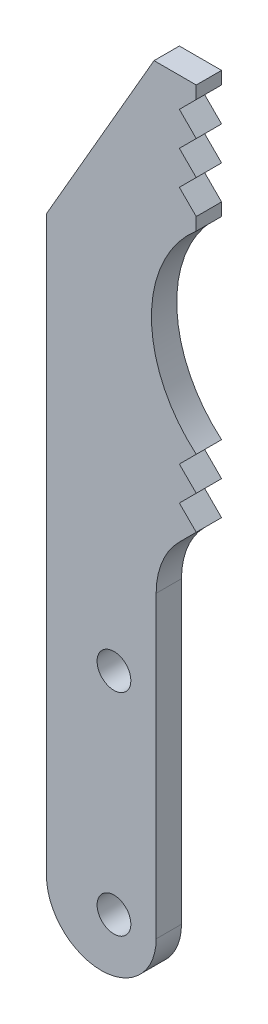
ISO-10303-21;
HEADER;
FILE_DESCRIPTION(('STEP AP214'),'2;1');
FILE_NAME('part.step','',(''),(''),'','','');
FILE_SCHEMA(('AUTOMOTIVE_DESIGN { 1 0 10303 214 1 1 1 1 }'));
ENDSEC;
DATA;
#1=APPLICATION_CONTEXT('core data for automotive mechanical design processes');
#2=APPLICATION_PROTOCOL_DEFINITION('international standard','automotive_design',2000,#1);
#3=PRODUCT_CONTEXT('',#1,'mechanical');
#4=PRODUCT('Part','Part','',(#3));
#5=PRODUCT_RELATED_PRODUCT_CATEGORY('part','',(#4));
#6=PRODUCT_DEFINITION_FORMATION('','',#4);
#7=PRODUCT_DEFINITION_CONTEXT('part definition',#1,'design');
#8=PRODUCT_DEFINITION('design','',#6,#7);
#9=PRODUCT_DEFINITION_SHAPE('','',#8);
#10=(LENGTH_UNIT() NAMED_UNIT(*) SI_UNIT(.MILLI.,.METRE.));
#11=(NAMED_UNIT(*) PLANE_ANGLE_UNIT() SI_UNIT($,.RADIAN.));
#12=(NAMED_UNIT(*) SI_UNIT($,.STERADIAN.) SOLID_ANGLE_UNIT());
#13=UNCERTAINTY_MEASURE_WITH_UNIT(LENGTH_MEASURE(1.E-05),#10,'distance_accuracy_value','');
#14=(GEOMETRIC_REPRESENTATION_CONTEXT(3) GLOBAL_UNCERTAINTY_ASSIGNED_CONTEXT((#13)) GLOBAL_UNIT_ASSIGNED_CONTEXT((#10,
#11,#12)) REPRESENTATION_CONTEXT('',''));
#15=CARTESIAN_POINT('',(0.,0.,0.));
#16=DIRECTION('',(0.,0.,1.));
#17=DIRECTION('',(1.,0.,0.));
#18=AXIS2_PLACEMENT_3D('',#15,#16,#17);
#19=CARTESIAN_POINT('',(-11.25,0.,1.5));
#20=DIRECTION('',(0.,0.,1.));
#21=DIRECTION('',(1.,0.,0.));
#22=AXIS2_PLACEMENT_3D('',#19,#20,#21);
#23=PLANE('',#22);
#24=CARTESIAN_POINT('',(-9.74999999999999,0.,1.5));
#25=DIRECTION('',(0.,0.,1.));
#26=DIRECTION('',(1.,0.,0.));
#27=AXIS2_PLACEMENT_3D('',#24,#25,#26);
#28=CIRCLE('',#27,2.);
#29=CARTESIAN_POINT('',(-7.74999999999999,0.,1.5));
#30=VERTEX_POINT('',#29);
#31=EDGE_CURVE('E213',#30,#30,#28,.T.);
#32=ORIENTED_EDGE('',*,*,#31,.F.);
#33=EDGE_LOOP('',(#32));
#34=FACE_BOUND('',#33,.T.);
#35=DIRECTION('',(-1.,0.,0.));
#36=VECTOR('',#35,1.);
#37=CARTESIAN_POINT('',(0.,90.,1.5));
#38=LINE('',#37,#36);
#39=CARTESIAN_POINT('',(0.,90.,1.5));
#40=VERTEX_POINT('',#39);
#41=CARTESIAN_POINT('',(-5.,90.,1.5));
#42=VERTEX_POINT('',#41);
#43=EDGE_CURVE('E248',#40,#42,#38,.T.);
#44=ORIENTED_EDGE('',*,*,#43,.T.);
#45=DIRECTION('',(-0.499999999999995,-0.866025403784442,0.));
#46=VECTOR('',#45,1.);
#47=CARTESIAN_POINT('',(-5.,90.,1.5));
#48=LINE('',#47,#46);
#49=CARTESIAN_POINT('',(-17.75,67.9163522034965,1.5));
#50=VERTEX_POINT('',#49);
#51=EDGE_CURVE('E136',#42,#50,#48,.T.);
#52=ORIENTED_EDGE('',*,*,#51,.T.);
#53=DIRECTION('',(0.,-1.,0.));
#54=VECTOR('',#53,1.);
#55=CARTESIAN_POINT('',(-17.75,67.9163522034965,1.5));
#56=LINE('',#55,#54);
#57=CARTESIAN_POINT('',(-17.75,0.,1.5));
#58=VERTEX_POINT('',#57);
#59=EDGE_CURVE('E299',#50,#58,#56,.T.);
#60=ORIENTED_EDGE('',*,*,#59,.T.);
#61=CARTESIAN_POINT('',(-11.25,0.,1.5));
#62=DIRECTION('',(0.,0.,1.));
#63=DIRECTION('',(1.,0.,0.));
#64=AXIS2_PLACEMENT_3D('',#61,#62,#63);
#65=CIRCLE('',#64,6.5);
#66=CARTESIAN_POINT('',(-4.74999999999999,0.,1.5));
#67=VERTEX_POINT('',#66);
#68=EDGE_CURVE('E318',#58,#67,#65,.T.);
#69=ORIENTED_EDGE('',*,*,#68,.T.);
#70=DIRECTION('',(0.,1.,0.));
#71=VECTOR('',#70,1.);
#72=CARTESIAN_POINT('',(-4.74999999999999,0.,1.5));
#73=LINE('',#72,#71);
#74=CARTESIAN_POINT('',(-4.74999999999999,35.460912703474,1.5));
#75=VERTEX_POINT('',#74);
#76=EDGE_CURVE('E315',#67,#75,#73,.T.);
#77=ORIENTED_EDGE('',*,*,#76,.T.);
#78=CARTESIAN_POINT('',(4.63908729652598,35.460912703474,1.5));
#79=DIRECTION('',(0.,0.,-1.));
#80=DIRECTION('',(1.,0.,0.));
#81=AXIS2_PLACEMENT_3D('',#78,#79,#80);
#82=CIRCLE('',#81,9.38908729652598);
#83=CARTESIAN_POINT('',(-2.,42.1,1.5));
#84=VERTEX_POINT('',#83);
#85=EDGE_CURVE('E317',#75,#84,#82,.T.);
#86=ORIENTED_EDGE('',*,*,#85,.T.);
#87=DIRECTION('',(0.707106781186545,0.70710678118655,0.));
#88=VECTOR('',#87,1.);
#89=CARTESIAN_POINT('',(-2.,42.1,1.5));
#90=LINE('',#89,#88);
#91=CARTESIAN_POINT('',(0.,44.1,1.5));
#92=VERTEX_POINT('',#91);
#93=EDGE_CURVE('E320',#84,#92,#90,.T.);
#94=ORIENTED_EDGE('',*,*,#93,.T.);
#95=DIRECTION('',(-0.707106781186543,0.707106781186552,0.));
#96=VECTOR('',#95,1.);
#97=CARTESIAN_POINT('',(0.,44.1,1.5));
#98=LINE('',#97,#96);
#99=CARTESIAN_POINT('',(-1.99999999999996,46.1,1.5));
#100=VERTEX_POINT('',#99);
#101=EDGE_CURVE('E326',#92,#100,#98,.T.);
#102=ORIENTED_EDGE('',*,*,#101,.T.);
#103=DIRECTION('',(0.707106781186545,0.70710678118655,0.));
#104=VECTOR('',#103,1.);
#105=CARTESIAN_POINT('',(-1.99999999999996,46.1,1.5));
#106=LINE('',#105,#104);
#107=CARTESIAN_POINT('',(0.,48.1,1.5));
#108=VERTEX_POINT('',#107);
#109=EDGE_CURVE('E328',#100,#108,#106,.T.);
#110=ORIENTED_EDGE('',*,*,#109,.T.);
#111=DIRECTION('',(-0.707106781186543,0.707106781186552,0.));
#112=VECTOR('',#111,1.);
#113=CARTESIAN_POINT('',(0.,48.1,1.5));
#114=LINE('',#113,#112);
#115=CARTESIAN_POINT('',(-1.99999999999992,50.1,1.5));
#116=VERTEX_POINT('',#115);
#117=EDGE_CURVE('E330',#108,#116,#114,.T.);
#118=ORIENTED_EDGE('',*,*,#117,.T.);
#119=DIRECTION('',(0.707106781186548,0.707106781186547,0.));
#120=VECTOR('',#119,1.);
#121=CARTESIAN_POINT('',(-1.99999999999992,50.1,1.5));
#122=LINE('',#121,#120);
#123=CARTESIAN_POINT('',(0.,52.1,1.5));
#124=VERTEX_POINT('',#123);
#125=EDGE_CURVE('E332',#116,#124,#122,.T.);
#126=ORIENTED_EDGE('',*,*,#125,.T.);
#127=CARTESIAN_POINT('',(9.69007223915278,63.55,1.5));
#128=DIRECTION('',(0.,0.,-1.));
#129=DIRECTION('',(1.,0.,0.));
#130=AXIS2_PLACEMENT_3D('',#127,#128,#129);
#131=CIRCLE('',#130,14.9999999999999);
#132=CARTESIAN_POINT('',(0.,75.,1.5));
#133=VERTEX_POINT('',#132);
#134=EDGE_CURVE('E334',#124,#133,#131,.T.);
#135=ORIENTED_EDGE('',*,*,#134,.T.);
#136=DIRECTION('',(0.,1.,0.));
#137=VECTOR('',#136,1.);
#138=CARTESIAN_POINT('',(0.,76.5,1.5));
#139=LINE('',#138,#137);
#140=CARTESIAN_POINT('',(0.,76.5,1.5));
#141=VERTEX_POINT('',#140);
#142=EDGE_CURVE('E336',#133,#141,#139,.T.);
#143=ORIENTED_EDGE('',*,*,#142,.T.);
#144=DIRECTION('',(-0.707106781186548,0.707106781186547,0.));
#145=VECTOR('',#144,1.);
#146=CARTESIAN_POINT('',(-1.99999999999992,78.5,1.5));
#147=LINE('',#146,#145);
#148=CARTESIAN_POINT('',(-1.99999999999992,78.5,1.5));
#149=VERTEX_POINT('',#148);
#150=EDGE_CURVE('E338',#141,#149,#147,.T.);
#151=ORIENTED_EDGE('',*,*,#150,.T.);
#152=DIRECTION('',(0.707106781186543,0.707106781186552,0.));
#153=VECTOR('',#152,1.);
#154=CARTESIAN_POINT('',(0.,80.5,1.5));
#155=LINE('',#154,#153);
#156=CARTESIAN_POINT('',(0.,80.5,1.5));
#157=VERTEX_POINT('',#156);
#158=EDGE_CURVE('E340',#149,#157,#155,.T.);
#159=ORIENTED_EDGE('',*,*,#158,.T.);
#160=DIRECTION('',(-0.707106781186545,0.70710678118655,0.));
#161=VECTOR('',#160,1.);
#162=CARTESIAN_POINT('',(-1.99999999999996,82.5,1.5));
#163=LINE('',#162,#161);
#164=CARTESIAN_POINT('',(-1.99999999999996,82.5,1.5));
#165=VERTEX_POINT('',#164);
#166=EDGE_CURVE('E342',#157,#165,#163,.T.);
#167=ORIENTED_EDGE('',*,*,#166,.T.);
#168=DIRECTION('',(0.707106781186543,0.707106781186552,0.));
#169=VECTOR('',#168,1.);
#170=CARTESIAN_POINT('',(0.,84.5,1.5));
#171=LINE('',#170,#169);
#172=CARTESIAN_POINT('',(0.,84.5,1.5));
#173=VERTEX_POINT('',#172);
#174=EDGE_CURVE('E191',#165,#173,#171,.T.);
#175=ORIENTED_EDGE('',*,*,#174,.T.);
#176=DIRECTION('',(-0.707106781186545,0.70710678118655,0.));
#177=VECTOR('',#176,1.);
#178=CARTESIAN_POINT('',(-2.,86.5,1.5));
#179=LINE('',#178,#177);
#180=CARTESIAN_POINT('',(-2.,86.5,1.5));
#181=VERTEX_POINT('',#180);
#182=EDGE_CURVE('E185',#173,#181,#179,.T.);
#183=ORIENTED_EDGE('',*,*,#182,.T.);
#184=DIRECTION('',(0.707106781186548,0.707106781186547,0.));
#185=VECTOR('',#184,1.);
#186=CARTESIAN_POINT('',(0.,88.5,1.5));
#187=LINE('',#186,#185);
#188=CARTESIAN_POINT('',(0.,88.5,1.5));
#189=VERTEX_POINT('',#188);
#190=EDGE_CURVE('E189',#181,#189,#187,.T.);
#191=ORIENTED_EDGE('',*,*,#190,.T.);
#192=DIRECTION('',(0.,1.,0.));
#193=VECTOR('',#192,1.);
#194=CARTESIAN_POINT('',(0.,88.5,1.5));
#195=LINE('',#194,#193);
#196=EDGE_CURVE('E57',#189,#40,#195,.T.);
#197=ORIENTED_EDGE('',*,*,#196,.T.);
#198=EDGE_LOOP('',(#44,#52,#60,#69,#77,#86,#94,#102,#110,#118,#126,#135,#143,#151,#159,#167,
#175,#183,#191,#197));
#199=FACE_BOUND('',#198,.T.);
#200=CARTESIAN_POINT('',(-9.74999999999999,25.,1.5));
#201=DIRECTION('',(0.,0.,1.));
#202=DIRECTION('',(1.,0.,0.));
#203=AXIS2_PLACEMENT_3D('',#200,#201,#202);
#204=CIRCLE('',#203,2.);
#205=CARTESIAN_POINT('',(-7.74999999999999,25.,1.5));
#206=VERTEX_POINT('',#205);
#207=EDGE_CURVE('E384',#206,#206,#204,.T.);
#208=ORIENTED_EDGE('',*,*,#207,.F.);
#209=EDGE_LOOP('',(#208));
#210=FACE_BOUND('',#209,.T.);
#211=ADVANCED_FACE('F40',(#34,#199,#210),#23,.T.);
#212=CARTESIAN_POINT('',(-11.25,0.,-1.5));
#213=DIRECTION('',(0.,0.,1.));
#214=DIRECTION('',(1.,0.,0.));
#215=AXIS2_PLACEMENT_3D('',#212,#213,#214);
#216=PLANE('',#215);
#217=DIRECTION('',(-1.,0.,0.));
#218=VECTOR('',#217,1.);
#219=CARTESIAN_POINT('',(0.,90.,-1.5));
#220=LINE('',#219,#218);
#221=CARTESIAN_POINT('',(0.,90.,-1.5));
#222=VERTEX_POINT('',#221);
#223=CARTESIAN_POINT('',(-5.,90.,-1.5));
#224=VERTEX_POINT('',#223);
#225=EDGE_CURVE('E209',#222,#224,#220,.T.);
#226=ORIENTED_EDGE('',*,*,#225,.F.);
#227=DIRECTION('',(0.,1.,0.));
#228=VECTOR('',#227,1.);
#229=CARTESIAN_POINT('',(0.,88.5,-1.5));
#230=LINE('',#229,#228);
#231=CARTESIAN_POINT('',(0.,88.5,-1.5));
#232=VERTEX_POINT('',#231);
#233=EDGE_CURVE('E128',#232,#222,#230,.T.);
#234=ORIENTED_EDGE('',*,*,#233,.F.);
#235=DIRECTION('',(0.707106781186548,0.707106781186547,0.));
#236=VECTOR('',#235,1.);
#237=CARTESIAN_POINT('',(0.,88.5,-1.5));
#238=LINE('',#237,#236);
#239=CARTESIAN_POINT('',(-2.,86.5,-1.5));
#240=VERTEX_POINT('',#239);
#241=EDGE_CURVE('E122',#240,#232,#238,.T.);
#242=ORIENTED_EDGE('',*,*,#241,.F.);
#243=DIRECTION('',(-0.707106781186545,0.70710678118655,0.));
#244=VECTOR('',#243,1.);
#245=CARTESIAN_POINT('',(-2.,86.5,-1.5));
#246=LINE('',#245,#244);
#247=CARTESIAN_POINT('',(0.,84.5,-1.5));
#248=VERTEX_POINT('',#247);
#249=EDGE_CURVE('E199',#248,#240,#246,.T.);
#250=ORIENTED_EDGE('',*,*,#249,.F.);
#251=DIRECTION('',(0.707106781186543,0.707106781186552,0.));
#252=VECTOR('',#251,1.);
#253=CARTESIAN_POINT('',(0.,84.5,-1.5));
#254=LINE('',#253,#252);
#255=CARTESIAN_POINT('',(-1.99999999999996,82.5,-1.5));
#256=VERTEX_POINT('',#255);
#257=EDGE_CURVE('E243',#256,#248,#254,.T.);
#258=ORIENTED_EDGE('',*,*,#257,.F.);
#259=DIRECTION('',(-0.707106781186545,0.70710678118655,0.));
#260=VECTOR('',#259,1.);
#261=CARTESIAN_POINT('',(-1.99999999999996,82.5,-1.5));
#262=LINE('',#261,#260);
#263=CARTESIAN_POINT('',(0.,80.5,-1.5));
#264=VERTEX_POINT('',#263);
#265=EDGE_CURVE('E241',#264,#256,#262,.T.);
#266=ORIENTED_EDGE('',*,*,#265,.F.);
#267=DIRECTION('',(0.707106781186543,0.707106781186552,0.));
#268=VECTOR('',#267,1.);
#269=CARTESIAN_POINT('',(0.,80.5,-1.5));
#270=LINE('',#269,#268);
#271=CARTESIAN_POINT('',(-1.99999999999992,78.5,-1.5));
#272=VERTEX_POINT('',#271);
#273=EDGE_CURVE('E239',#272,#264,#270,.T.);
#274=ORIENTED_EDGE('',*,*,#273,.F.);
#275=DIRECTION('',(-0.707106781186548,0.707106781186547,0.));
#276=VECTOR('',#275,1.);
#277=CARTESIAN_POINT('',(-1.99999999999992,78.5,-1.5));
#278=LINE('',#277,#276);
#279=CARTESIAN_POINT('',(0.,76.5,-1.5));
#280=VERTEX_POINT('',#279);
#281=EDGE_CURVE('E237',#280,#272,#278,.T.);
#282=ORIENTED_EDGE('',*,*,#281,.F.);
#283=DIRECTION('',(0.,1.,0.));
#284=VECTOR('',#283,1.);
#285=CARTESIAN_POINT('',(0.,76.5,-1.5));
#286=LINE('',#285,#284);
#287=CARTESIAN_POINT('',(0.,75.,-1.5));
#288=VERTEX_POINT('',#287);
#289=EDGE_CURVE('E235',#288,#280,#286,.T.);
#290=ORIENTED_EDGE('',*,*,#289,.F.);
#291=CARTESIAN_POINT('',(9.69007223915278,63.55,-1.5));
#292=DIRECTION('',(0.,0.,-1.));
#293=DIRECTION('',(1.,0.,0.));
#294=AXIS2_PLACEMENT_3D('',#291,#292,#293);
#295=CIRCLE('',#294,14.9999999999999);
#296=CARTESIAN_POINT('',(0.,52.1,-1.5));
#297=VERTEX_POINT('',#296);
#298=EDGE_CURVE('E233',#297,#288,#295,.T.);
#299=ORIENTED_EDGE('',*,*,#298,.F.);
#300=DIRECTION('',(0.707106781186548,0.707106781186547,0.));
#301=VECTOR('',#300,1.);
#302=CARTESIAN_POINT('',(-1.99999999999992,50.1,-1.5));
#303=LINE('',#302,#301);
#304=CARTESIAN_POINT('',(-1.99999999999992,50.1,-1.5));
#305=VERTEX_POINT('',#304);
#306=EDGE_CURVE('E231',#305,#297,#303,.T.);
#307=ORIENTED_EDGE('',*,*,#306,.F.);
#308=DIRECTION('',(-0.707106781186543,0.707106781186552,0.));
#309=VECTOR('',#308,1.);
#310=CARTESIAN_POINT('',(0.,48.1,-1.5));
#311=LINE('',#310,#309);
#312=CARTESIAN_POINT('',(0.,48.1,-1.5));
#313=VERTEX_POINT('',#312);
#314=EDGE_CURVE('E229',#313,#305,#311,.T.);
#315=ORIENTED_EDGE('',*,*,#314,.F.);
#316=DIRECTION('',(0.707106781186545,0.70710678118655,0.));
#317=VECTOR('',#316,1.);
#318=CARTESIAN_POINT('',(-1.99999999999996,46.1,-1.5));
#319=LINE('',#318,#317);
#320=CARTESIAN_POINT('',(-1.99999999999996,46.1,-1.5));
#321=VERTEX_POINT('',#320);
#322=EDGE_CURVE('E227',#321,#313,#319,.T.);
#323=ORIENTED_EDGE('',*,*,#322,.F.);
#324=DIRECTION('',(-0.707106781186543,0.707106781186552,0.));
#325=VECTOR('',#324,1.);
#326=CARTESIAN_POINT('',(0.,44.1,-1.5));
#327=LINE('',#326,#325);
#328=CARTESIAN_POINT('',(0.,44.1,-1.5));
#329=VERTEX_POINT('',#328);
#330=EDGE_CURVE('E225',#329,#321,#327,.T.);
#331=ORIENTED_EDGE('',*,*,#330,.F.);
#332=DIRECTION('',(0.707106781186545,0.70710678118655,0.));
#333=VECTOR('',#332,1.);
#334=CARTESIAN_POINT('',(-2.,42.1,-1.5));
#335=LINE('',#334,#333);
#336=CARTESIAN_POINT('',(-2.,42.1,-1.5));
#337=VERTEX_POINT('',#336);
#338=EDGE_CURVE('E223',#337,#329,#335,.T.);
#339=ORIENTED_EDGE('',*,*,#338,.F.);
#340=CARTESIAN_POINT('',(4.63908729652598,35.460912703474,-1.5));
#341=DIRECTION('',(0.,0.,-1.));
#342=DIRECTION('',(1.,0.,0.));
#343=AXIS2_PLACEMENT_3D('',#340,#341,#342);
#344=CIRCLE('',#343,9.38908729652598);
#345=CARTESIAN_POINT('',(-4.74999999999999,35.460912703474,-1.5));
#346=VERTEX_POINT('',#345);
#347=EDGE_CURVE('E221',#346,#337,#344,.T.);
#348=ORIENTED_EDGE('',*,*,#347,.F.);
#349=DIRECTION('',(0.,1.,0.));
#350=VECTOR('',#349,1.);
#351=CARTESIAN_POINT('',(-4.74999999999999,0.,-1.5));
#352=LINE('',#351,#350);
#353=CARTESIAN_POINT('',(-4.74999999999999,0.,-1.5));
#354=VERTEX_POINT('',#353);
#355=EDGE_CURVE('E219',#354,#346,#352,.T.);
#356=ORIENTED_EDGE('',*,*,#355,.F.);
#357=CARTESIAN_POINT('',(-11.25,0.,-1.5));
#358=DIRECTION('',(0.,0.,1.));
#359=DIRECTION('',(1.,0.,0.));
#360=AXIS2_PLACEMENT_3D('',#357,#358,#359);
#361=CIRCLE('',#360,6.5);
#362=CARTESIAN_POINT('',(-17.75,0.,-1.5));
#363=VERTEX_POINT('',#362);
#364=EDGE_CURVE('E217',#363,#354,#361,.T.);
#365=ORIENTED_EDGE('',*,*,#364,.F.);
#366=DIRECTION('',(0.,-1.,0.));
#367=VECTOR('',#366,1.);
#368=CARTESIAN_POINT('',(-17.75,67.9163522034965,-1.5));
#369=LINE('',#368,#367);
#370=CARTESIAN_POINT('',(-17.75,67.9163522034965,-1.5));
#371=VERTEX_POINT('',#370);
#372=EDGE_CURVE('E215',#371,#363,#369,.T.);
#373=ORIENTED_EDGE('',*,*,#372,.F.);
#374=DIRECTION('',(-0.499999999999995,-0.866025403784442,0.));
#375=VECTOR('',#374,1.);
#376=CARTESIAN_POINT('',(-5.,90.,-1.5));
#377=LINE('',#376,#375);
#378=EDGE_CURVE('E212',#224,#371,#377,.T.);
#379=ORIENTED_EDGE('',*,*,#378,.F.);
#380=EDGE_LOOP('',(#226,#234,#242,#250,#258,#266,#274,#282,#290,#299,#307,#315,#323,#331,#339,
#348,#356,#365,#373,#379));
#381=FACE_BOUND('',#380,.T.);
#382=CARTESIAN_POINT('',(-9.74999999999999,0.,-1.5));
#383=DIRECTION('',(0.,0.,1.));
#384=DIRECTION('',(1.,0.,0.));
#385=AXIS2_PLACEMENT_3D('',#382,#383,#384);
#386=CIRCLE('',#385,2.);
#387=CARTESIAN_POINT('',(-7.74999999999999,0.,-1.5));
#388=VERTEX_POINT('',#387);
#389=EDGE_CURVE('E390',#388,#388,#386,.T.);
#390=ORIENTED_EDGE('',*,*,#389,.T.);
#391=EDGE_LOOP('',(#390));
#392=FACE_BOUND('',#391,.T.);
#393=CARTESIAN_POINT('',(-9.74999999999999,25.,-1.5));
#394=DIRECTION('',(0.,0.,1.));
#395=DIRECTION('',(1.,0.,0.));
#396=AXIS2_PLACEMENT_3D('',#393,#394,#395);
#397=CIRCLE('',#396,2.);
#398=CARTESIAN_POINT('',(-7.74999999999999,25.,-1.5));
#399=VERTEX_POINT('',#398);
#400=EDGE_CURVE('E387',#399,#399,#397,.T.);
#401=ORIENTED_EDGE('',*,*,#400,.T.);
#402=EDGE_LOOP('',(#401));
#403=FACE_BOUND('',#402,.T.);
#404=ADVANCED_FACE('F303',(#381,#392,#403),#216,.F.);
#405=CARTESIAN_POINT('',(0.,90.,1.5));
#406=DIRECTION('',(0.,-1.,0.));
#407=DIRECTION('',(0.,0.,-1.));
#408=AXIS2_PLACEMENT_3D('',#405,#406,#407);
#409=PLANE('',#408);
#410=ORIENTED_EDGE('',*,*,#225,.T.);
#411=DIRECTION('',(0.,0.,-1.));
#412=VECTOR('',#411,1.);
#413=CARTESIAN_POINT('',(-5.,90.,1.5));
#414=LINE('',#413,#412);
#415=EDGE_CURVE('E11',#42,#224,#414,.T.);
#416=ORIENTED_EDGE('',*,*,#415,.F.);
#417=ORIENTED_EDGE('',*,*,#43,.F.);
#418=DIRECTION('',(0.,0.,-1.));
#419=VECTOR('',#418,1.);
#420=CARTESIAN_POINT('',(0.,90.,1.5));
#421=LINE('',#420,#419);
#422=EDGE_CURVE('E205',#40,#222,#421,.T.);
#423=ORIENTED_EDGE('',*,*,#422,.T.);
#424=EDGE_LOOP('',(#410,#416,#417,#423));
#425=FACE_BOUND('',#424,.T.);
#426=ADVANCED_FACE('F42',(#425),#409,.F.);
#427=CARTESIAN_POINT('',(-5.,90.,1.5));
#428=DIRECTION('',(0.866025403784441,-0.499999999999995,0.));
#429=DIRECTION('',(0.499999999999995,0.866025403784442,0.));
#430=AXIS2_PLACEMENT_3D('',#427,#428,#429);
#431=PLANE('',#430);
#432=ORIENTED_EDGE('',*,*,#378,.T.);
#433=DIRECTION('',(0.,0.,-1.));
#434=VECTOR('',#433,1.);
#435=CARTESIAN_POINT('',(-17.75,67.9163522034965,1.5));
#436=LINE('',#435,#434);
#437=EDGE_CURVE('E49',#50,#371,#436,.T.);
#438=ORIENTED_EDGE('',*,*,#437,.F.);
#439=ORIENTED_EDGE('',*,*,#51,.F.);
#440=ORIENTED_EDGE('',*,*,#415,.T.);
#441=EDGE_LOOP('',(#432,#438,#439,#440));
#442=FACE_BOUND('',#441,.T.);
#443=ADVANCED_FACE('F581',(#442),#431,.F.);
#444=CARTESIAN_POINT('',(-17.75,67.9163522034965,1.5));
#445=DIRECTION('',(1.,0.,0.));
#446=DIRECTION('',(0.,1.,0.));
#447=AXIS2_PLACEMENT_3D('',#444,#445,#446);
#448=PLANE('',#447);
#449=ORIENTED_EDGE('',*,*,#372,.T.);
#450=DIRECTION('',(0.,0.,-1.));
#451=VECTOR('',#450,1.);
#452=CARTESIAN_POINT('',(-17.75,0.,1.5));
#453=LINE('',#452,#451);
#454=EDGE_CURVE('E291',#58,#363,#453,.T.);
#455=ORIENTED_EDGE('',*,*,#454,.F.);
#456=ORIENTED_EDGE('',*,*,#59,.F.);
#457=ORIENTED_EDGE('',*,*,#437,.T.);
#458=EDGE_LOOP('',(#449,#455,#456,#457));
#459=FACE_BOUND('',#458,.T.);
#460=ADVANCED_FACE('F297',(#459),#448,.F.);
#461=CARTESIAN_POINT('',(-11.25,0.,1.5));
#462=DIRECTION('',(0.,0.,-1.));
#463=DIRECTION('',(-1.,0.,0.));
#464=AXIS2_PLACEMENT_3D('',#461,#462,#463);
#465=CYLINDRICAL_SURFACE('',#464,6.5);
#466=ORIENTED_EDGE('',*,*,#364,.T.);
#467=DIRECTION('',(0.,0.,-1.));
#468=VECTOR('',#467,1.);
#469=CARTESIAN_POINT('',(-4.74999999999999,0.,1.5));
#470=LINE('',#469,#468);
#471=EDGE_CURVE('E288',#67,#354,#470,.T.);
#472=ORIENTED_EDGE('',*,*,#471,.F.);
#473=ORIENTED_EDGE('',*,*,#68,.F.);
#474=ORIENTED_EDGE('',*,*,#454,.T.);
#475=EDGE_LOOP('',(#466,#472,#473,#474));
#476=FACE_BOUND('',#475,.T.);
#477=ADVANCED_FACE('F309',(#476),#465,.T.);
#478=CARTESIAN_POINT('',(-4.74999999999999,0.,1.5));
#479=DIRECTION('',(-1.,0.,0.));
#480=DIRECTION('',(0.,-1.,0.));
#481=AXIS2_PLACEMENT_3D('',#478,#479,#480);
#482=PLANE('',#481);
#483=ORIENTED_EDGE('',*,*,#355,.T.);
#484=DIRECTION('',(0.,0.,-1.));
#485=VECTOR('',#484,1.);
#486=CARTESIAN_POINT('',(-4.74999999999999,35.460912703474,1.5));
#487=LINE('',#486,#485);
#488=EDGE_CURVE('E285',#75,#346,#487,.T.);
#489=ORIENTED_EDGE('',*,*,#488,.F.);
#490=ORIENTED_EDGE('',*,*,#76,.F.);
#491=ORIENTED_EDGE('',*,*,#471,.T.);
#492=EDGE_LOOP('',(#483,#489,#490,#491));
#493=FACE_BOUND('',#492,.T.);
#494=ADVANCED_FACE('F313',(#493),#482,.F.);
#495=CARTESIAN_POINT('',(4.63908729652598,35.460912703474,1.5));
#496=DIRECTION('',(0.,0.,-1.));
#497=DIRECTION('',(-1.,0.,0.));
#498=AXIS2_PLACEMENT_3D('',#495,#496,#497);
#499=CYLINDRICAL_SURFACE('',#498,9.38908729652598);
#500=ORIENTED_EDGE('',*,*,#347,.T.);
#501=DIRECTION('',(0.,0.,-1.));
#502=VECTOR('',#501,1.);
#503=CARTESIAN_POINT('',(-2.,42.1,1.5));
#504=LINE('',#503,#502);
#505=EDGE_CURVE('E282',#84,#337,#504,.T.);
#506=ORIENTED_EDGE('',*,*,#505,.F.);
#507=ORIENTED_EDGE('',*,*,#85,.F.);
#508=ORIENTED_EDGE('',*,*,#488,.T.);
#509=EDGE_LOOP('',(#500,#506,#507,#508));
#510=FACE_BOUND('',#509,.T.);
#511=ADVANCED_FACE('F542',(#510),#499,.F.);
#512=CARTESIAN_POINT('',(-2.,42.1,1.5));
#513=DIRECTION('',(-0.70710678118655,0.707106781186545,0.));
#514=DIRECTION('',(-0.707106781186545,-0.70710678118655,0.));
#515=AXIS2_PLACEMENT_3D('',#512,#513,#514);
#516=PLANE('',#515);
#517=ORIENTED_EDGE('',*,*,#338,.T.);
#518=DIRECTION('',(0.,0.,-1.));
#519=VECTOR('',#518,1.);
#520=CARTESIAN_POINT('',(0.,44.1,1.5));
#521=LINE('',#520,#519);
#522=EDGE_CURVE('E279',#92,#329,#521,.T.);
#523=ORIENTED_EDGE('',*,*,#522,.F.);
#524=ORIENTED_EDGE('',*,*,#93,.F.);
#525=ORIENTED_EDGE('',*,*,#505,.T.);
#526=EDGE_LOOP('',(#517,#523,#524,#525));
#527=FACE_BOUND('',#526,.T.);
#528=ADVANCED_FACE('F531',(#527),#516,.F.);
#529=CARTESIAN_POINT('',(0.,44.1,1.5));
#530=DIRECTION('',(-0.707106781186552,-0.707106781186543,0.));
#531=DIRECTION('',(0.707106781186543,-0.707106781186552,0.));
#532=AXIS2_PLACEMENT_3D('',#529,#530,#531);
#533=PLANE('',#532);
#534=ORIENTED_EDGE('',*,*,#330,.T.);
#535=DIRECTION('',(0.,0.,-1.));
#536=VECTOR('',#535,1.);
#537=CARTESIAN_POINT('',(-1.99999999999996,46.1,1.5));
#538=LINE('',#537,#536);
#539=EDGE_CURVE('E276',#100,#321,#538,.T.);
#540=ORIENTED_EDGE('',*,*,#539,.F.);
#541=ORIENTED_EDGE('',*,*,#101,.F.);
#542=ORIENTED_EDGE('',*,*,#522,.T.);
#543=EDGE_LOOP('',(#534,#540,#541,#542));
#544=FACE_BOUND('',#543,.T.);
#545=ADVANCED_FACE('F520',(#544),#533,.F.);
#546=CARTESIAN_POINT('',(-1.99999999999996,46.1,1.5));
#547=DIRECTION('',(-0.70710678118655,0.707106781186545,0.));
#548=DIRECTION('',(-0.707106781186545,-0.70710678118655,0.));
#549=AXIS2_PLACEMENT_3D('',#546,#547,#548);
#550=PLANE('',#549);
#551=ORIENTED_EDGE('',*,*,#322,.T.);
#552=DIRECTION('',(0.,0.,-1.));
#553=VECTOR('',#552,1.);
#554=CARTESIAN_POINT('',(0.,48.1,1.5));
#555=LINE('',#554,#553);
#556=EDGE_CURVE('E273',#108,#313,#555,.T.);
#557=ORIENTED_EDGE('',*,*,#556,.F.);
#558=ORIENTED_EDGE('',*,*,#109,.F.);
#559=ORIENTED_EDGE('',*,*,#539,.T.);
#560=EDGE_LOOP('',(#551,#557,#558,#559));
#561=FACE_BOUND('',#560,.T.);
#562=ADVANCED_FACE('F509',(#561),#550,.F.);
#563=CARTESIAN_POINT('',(0.,48.1,1.5));
#564=DIRECTION('',(-0.707106781186552,-0.707106781186543,0.));
#565=DIRECTION('',(0.707106781186543,-0.707106781186552,0.));
#566=AXIS2_PLACEMENT_3D('',#563,#564,#565);
#567=PLANE('',#566);
#568=ORIENTED_EDGE('',*,*,#314,.T.);
#569=DIRECTION('',(0.,0.,-1.));
#570=VECTOR('',#569,1.);
#571=CARTESIAN_POINT('',(-1.99999999999992,50.1,1.5));
#572=LINE('',#571,#570);
#573=EDGE_CURVE('E270',#116,#305,#572,.T.);
#574=ORIENTED_EDGE('',*,*,#573,.F.);
#575=ORIENTED_EDGE('',*,*,#117,.F.);
#576=ORIENTED_EDGE('',*,*,#556,.T.);
#577=EDGE_LOOP('',(#568,#574,#575,#576));
#578=FACE_BOUND('',#577,.T.);
#579=ADVANCED_FACE('F498',(#578),#567,.F.);
#580=CARTESIAN_POINT('',(-1.99999999999992,50.1,1.5));
#581=DIRECTION('',(-0.707106781186547,0.707106781186548,0.));
#582=DIRECTION('',(-0.707106781186548,-0.707106781186547,0.));
#583=AXIS2_PLACEMENT_3D('',#580,#581,#582);
#584=PLANE('',#583);
#585=ORIENTED_EDGE('',*,*,#306,.T.);
#586=DIRECTION('',(0.,0.,-1.));
#587=VECTOR('',#586,1.);
#588=CARTESIAN_POINT('',(0.,52.1,1.5));
#589=LINE('',#588,#587);
#590=EDGE_CURVE('E267',#124,#297,#589,.T.);
#591=ORIENTED_EDGE('',*,*,#590,.F.);
#592=ORIENTED_EDGE('',*,*,#125,.F.);
#593=ORIENTED_EDGE('',*,*,#573,.T.);
#594=EDGE_LOOP('',(#585,#591,#592,#593));
#595=FACE_BOUND('',#594,.T.);
#596=ADVANCED_FACE('F487',(#595),#584,.F.);
#597=CARTESIAN_POINT('',(9.69007223915278,63.55,1.5));
#598=DIRECTION('',(0.,0.,-1.));
#599=DIRECTION('',(-1.,0.,0.));
#600=AXIS2_PLACEMENT_3D('',#597,#598,#599);
#601=CYLINDRICAL_SURFACE('',#600,14.9999999999999);
#602=ORIENTED_EDGE('',*,*,#298,.T.);
#603=DIRECTION('',(0.,0.,-1.));
#604=VECTOR('',#603,1.);
#605=CARTESIAN_POINT('',(0.,75.,1.5));
#606=LINE('',#605,#604);
#607=EDGE_CURVE('E264',#133,#288,#606,.T.);
#608=ORIENTED_EDGE('',*,*,#607,.F.);
#609=ORIENTED_EDGE('',*,*,#134,.F.);
#610=ORIENTED_EDGE('',*,*,#590,.T.);
#611=EDGE_LOOP('',(#602,#608,#609,#610));
#612=FACE_BOUND('',#611,.T.);
#613=ADVANCED_FACE('F476',(#612),#601,.F.);
#614=CARTESIAN_POINT('',(0.,76.5,1.5));
#615=DIRECTION('',(-1.,0.,0.));
#616=DIRECTION('',(0.,-1.,0.));
#617=AXIS2_PLACEMENT_3D('',#614,#615,#616);
#618=PLANE('',#617);
#619=ORIENTED_EDGE('',*,*,#289,.T.);
#620=DIRECTION('',(0.,0.,-1.));
#621=VECTOR('',#620,1.);
#622=CARTESIAN_POINT('',(0.,76.5,1.5));
#623=LINE('',#622,#621);
#624=EDGE_CURVE('E261',#141,#280,#623,.T.);
#625=ORIENTED_EDGE('',*,*,#624,.F.);
#626=ORIENTED_EDGE('',*,*,#142,.F.);
#627=ORIENTED_EDGE('',*,*,#607,.T.);
#628=EDGE_LOOP('',(#619,#625,#626,#627));
#629=FACE_BOUND('',#628,.T.);
#630=ADVANCED_FACE('F465',(#629),#618,.F.);
#631=CARTESIAN_POINT('',(-1.99999999999992,78.5,1.5));
#632=DIRECTION('',(-0.707106781186547,-0.707106781186548,0.));
#633=DIRECTION('',(0.707106781186548,-0.707106781186547,0.));
#634=AXIS2_PLACEMENT_3D('',#631,#632,#633);
#635=PLANE('',#634);
#636=ORIENTED_EDGE('',*,*,#281,.T.);
#637=DIRECTION('',(0.,0.,-1.));
#638=VECTOR('',#637,1.);
#639=CARTESIAN_POINT('',(-1.99999999999992,78.5,1.5));
#640=LINE('',#639,#638);
#641=EDGE_CURVE('E258',#149,#272,#640,.T.);
#642=ORIENTED_EDGE('',*,*,#641,.F.);
#643=ORIENTED_EDGE('',*,*,#150,.F.);
#644=ORIENTED_EDGE('',*,*,#624,.T.);
#645=EDGE_LOOP('',(#636,#642,#643,#644));
#646=FACE_BOUND('',#645,.T.);
#647=ADVANCED_FACE('F454',(#646),#635,.F.);
#648=CARTESIAN_POINT('',(0.,80.5,1.5));
#649=DIRECTION('',(-0.707106781186552,0.707106781186543,0.));
#650=DIRECTION('',(-0.707106781186543,-0.707106781186552,0.));
#651=AXIS2_PLACEMENT_3D('',#648,#649,#650);
#652=PLANE('',#651);
#653=ORIENTED_EDGE('',*,*,#273,.T.);
#654=DIRECTION('',(0.,0.,-1.));
#655=VECTOR('',#654,1.);
#656=CARTESIAN_POINT('',(0.,80.5,1.5));
#657=LINE('',#656,#655);
#658=EDGE_CURVE('E255',#157,#264,#657,.T.);
#659=ORIENTED_EDGE('',*,*,#658,.F.);
#660=ORIENTED_EDGE('',*,*,#158,.F.);
#661=ORIENTED_EDGE('',*,*,#641,.T.);
#662=EDGE_LOOP('',(#653,#659,#660,#661));
#663=FACE_BOUND('',#662,.T.);
#664=ADVANCED_FACE('F444',(#663),#652,.F.);
#665=CARTESIAN_POINT('',(-1.99999999999996,82.5,1.5));
#666=DIRECTION('',(-0.70710678118655,-0.707106781186545,0.));
#667=DIRECTION('',(0.707106781186545,-0.70710678118655,0.));
#668=AXIS2_PLACEMENT_3D('',#665,#666,#667);
#669=PLANE('',#668);
#670=ORIENTED_EDGE('',*,*,#265,.T.);
#671=DIRECTION('',(0.,0.,-1.));
#672=VECTOR('',#671,1.);
#673=CARTESIAN_POINT('',(-1.99999999999996,82.5,1.5));
#674=LINE('',#673,#672);
#675=EDGE_CURVE('E252',#165,#256,#674,.T.);
#676=ORIENTED_EDGE('',*,*,#675,.F.);
#677=ORIENTED_EDGE('',*,*,#166,.F.);
#678=ORIENTED_EDGE('',*,*,#658,.T.);
#679=EDGE_LOOP('',(#670,#676,#677,#678));
#680=FACE_BOUND('',#679,.T.);
#681=ADVANCED_FACE('F348',(#680),#669,.F.);
#682=CARTESIAN_POINT('',(0.,84.5,1.5));
#683=DIRECTION('',(-0.707106781186552,0.707106781186543,0.));
#684=DIRECTION('',(-0.707106781186543,-0.707106781186552,0.));
#685=AXIS2_PLACEMENT_3D('',#682,#683,#684);
#686=PLANE('',#685);
#687=ORIENTED_EDGE('',*,*,#257,.T.);
#688=DIRECTION('',(0.,0.,-1.));
#689=VECTOR('',#688,1.);
#690=CARTESIAN_POINT('',(0.,84.5,1.5));
#691=LINE('',#690,#689);
#692=EDGE_CURVE('E200',#173,#248,#691,.T.);
#693=ORIENTED_EDGE('',*,*,#692,.F.);
#694=ORIENTED_EDGE('',*,*,#174,.F.);
#695=ORIENTED_EDGE('',*,*,#675,.T.);
#696=EDGE_LOOP('',(#687,#693,#694,#695));
#697=FACE_BOUND('',#696,.T.);
#698=ADVANCED_FACE('F352',(#697),#686,.F.);
#699=CARTESIAN_POINT('',(-2.,86.5,1.5));
#700=DIRECTION('',(-0.70710678118655,-0.707106781186545,0.));
#701=DIRECTION('',(0.707106781186545,-0.70710678118655,0.));
#702=AXIS2_PLACEMENT_3D('',#699,#700,#701);
#703=PLANE('',#702);
#704=ORIENTED_EDGE('',*,*,#249,.T.);
#705=DIRECTION('',(0.,0.,-1.));
#706=VECTOR('',#705,1.);
#707=CARTESIAN_POINT('',(-2.,86.5,1.5));
#708=LINE('',#707,#706);
#709=EDGE_CURVE('E196',#181,#240,#708,.T.);
#710=ORIENTED_EDGE('',*,*,#709,.F.);
#711=ORIENTED_EDGE('',*,*,#182,.F.);
#712=ORIENTED_EDGE('',*,*,#692,.T.);
#713=EDGE_LOOP('',(#704,#710,#711,#712));
#714=FACE_BOUND('',#713,.T.);
#715=ADVANCED_FACE('F197',(#714),#703,.F.);
#716=CARTESIAN_POINT('',(0.,88.5,1.5));
#717=DIRECTION('',(-0.707106781186547,0.707106781186548,0.));
#718=DIRECTION('',(-0.707106781186548,-0.707106781186547,0.));
#719=AXIS2_PLACEMENT_3D('',#716,#717,#718);
#720=PLANE('',#719);
#721=ORIENTED_EDGE('',*,*,#241,.T.);
#722=DIRECTION('',(0.,0.,-1.));
#723=VECTOR('',#722,1.);
#724=CARTESIAN_POINT('',(0.,88.5,1.5));
#725=LINE('',#724,#723);
#726=EDGE_CURVE('E201',#189,#232,#725,.T.);
#727=ORIENTED_EDGE('',*,*,#726,.F.);
#728=ORIENTED_EDGE('',*,*,#190,.F.);
#729=ORIENTED_EDGE('',*,*,#709,.T.);
#730=EDGE_LOOP('',(#721,#727,#728,#729));
#731=FACE_BOUND('',#730,.T.);
#732=ADVANCED_FACE('F203',(#731),#720,.F.);
#733=CARTESIAN_POINT('',(0.,88.5,1.5));
#734=DIRECTION('',(-1.,0.,0.));
#735=DIRECTION('',(0.,0.,1.));
#736=AXIS2_PLACEMENT_3D('',#733,#734,#735);
#737=PLANE('',#736);
#738=ORIENTED_EDGE('',*,*,#233,.T.);
#739=ORIENTED_EDGE('',*,*,#422,.F.);
#740=ORIENTED_EDGE('',*,*,#196,.F.);
#741=ORIENTED_EDGE('',*,*,#726,.T.);
#742=EDGE_LOOP('',(#738,#739,#740,#741));
#743=FACE_BOUND('',#742,.T.);
#744=ADVANCED_FACE('F356',(#743),#737,.F.);
#745=CARTESIAN_POINT('',(-9.74999999999999,0.,1.5));
#746=DIRECTION('',(0.,0.,-1.));
#747=DIRECTION('',(-1.,0.,0.));
#748=AXIS2_PLACEMENT_3D('',#745,#746,#747);
#749=CYLINDRICAL_SURFACE('',#748,2.);
#750=ORIENTED_EDGE('',*,*,#31,.T.);
#751=EDGE_LOOP('',(#750));
#752=FACE_BOUND('',#751,.T.);
#753=ORIENTED_EDGE('',*,*,#389,.F.);
#754=EDGE_LOOP('',(#753));
#755=FACE_BOUND('',#754,.T.);
#756=ADVANCED_FACE('F358',(#752,#755),#749,.F.);
#757=CARTESIAN_POINT('',(-9.74999999999999,25.,1.5));
#758=DIRECTION('',(0.,0.,-1.));
#759=DIRECTION('',(-1.,0.,0.));
#760=AXIS2_PLACEMENT_3D('',#757,#758,#759);
#761=CYLINDRICAL_SURFACE('',#760,2.);
#762=ORIENTED_EDGE('',*,*,#207,.T.);
#763=EDGE_LOOP('',(#762));
#764=FACE_BOUND('',#763,.T.);
#765=ORIENTED_EDGE('',*,*,#400,.F.);
#766=EDGE_LOOP('',(#765));
#767=FACE_BOUND('',#766,.T.);
#768=ADVANCED_FACE('F364',(#764,#767),#761,.F.);
#769=CLOSED_SHELL('',(#211,#404,#426,#443,#460,#477,#494,#511,#528,#545,#562,#579,#596,#613,
#630,#647,#664,#681,#698,#715,#732,#744,#756,#768));
#770=MANIFOLD_SOLID_BREP('B2',#769);
#771=ADVANCED_BREP_SHAPE_REPRESENTATION('',(#18,#770),#14);
#772=SHAPE_DEFINITION_REPRESENTATION(#9,#771);
ENDSEC;
END-ISO-10303-21;
